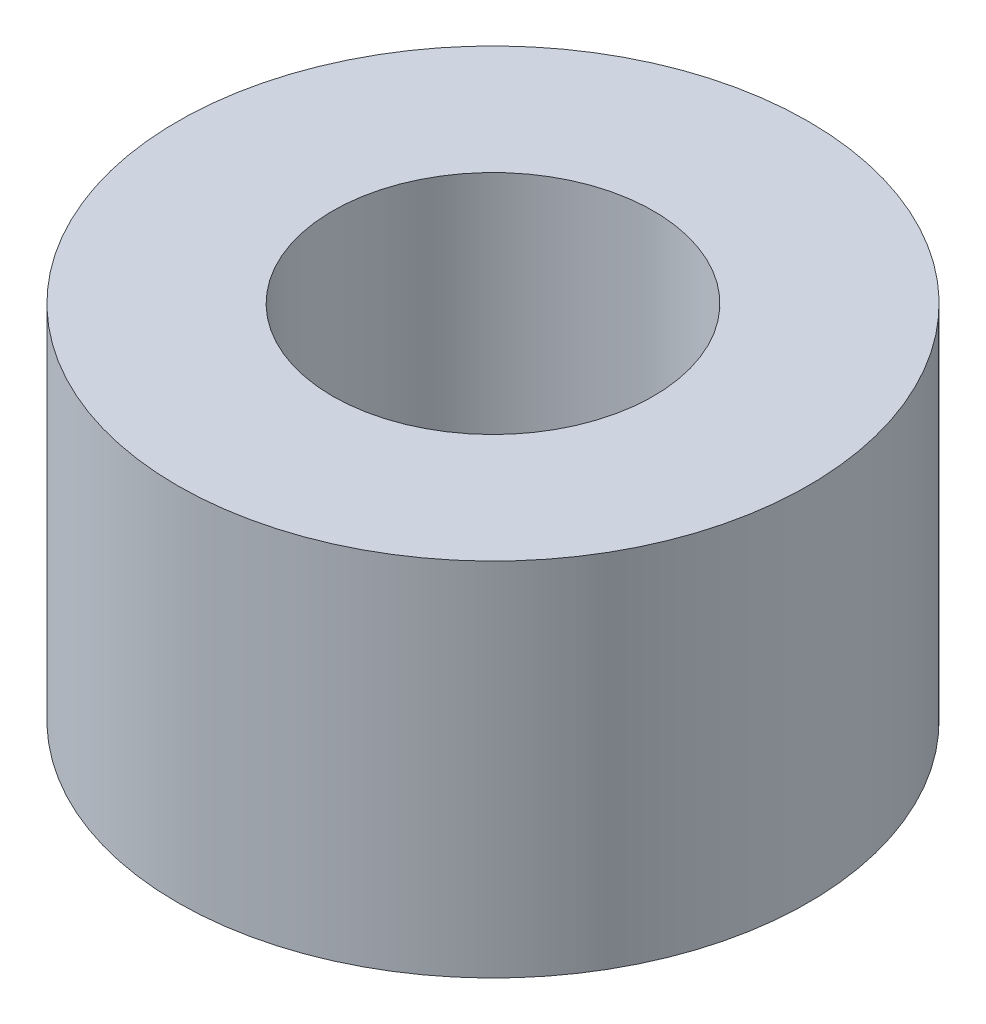
ISO-10303-21;
HEADER;
FILE_DESCRIPTION(('STEP AP214'),'2;1');
FILE_NAME('part.step','',(''),(''),'','','');
FILE_SCHEMA(('AUTOMOTIVE_DESIGN { 1 0 10303 214 1 1 1 1 }'));
ENDSEC;
DATA;
#1=APPLICATION_CONTEXT('core data for automotive mechanical design processes');
#2=APPLICATION_PROTOCOL_DEFINITION('international standard','automotive_design',2000,#1);
#3=PRODUCT_CONTEXT('',#1,'mechanical');
#4=PRODUCT('Part','Part','',(#3));
#5=PRODUCT_RELATED_PRODUCT_CATEGORY('part','',(#4));
#6=PRODUCT_DEFINITION_FORMATION('','',#4);
#7=PRODUCT_DEFINITION_CONTEXT('part definition',#1,'design');
#8=PRODUCT_DEFINITION('design','',#6,#7);
#9=PRODUCT_DEFINITION_SHAPE('','',#8);
#10=(LENGTH_UNIT() NAMED_UNIT(*) SI_UNIT(.MILLI.,.METRE.));
#11=(NAMED_UNIT(*) PLANE_ANGLE_UNIT() SI_UNIT($,.RADIAN.));
#12=(NAMED_UNIT(*) SI_UNIT($,.STERADIAN.) SOLID_ANGLE_UNIT());
#13=UNCERTAINTY_MEASURE_WITH_UNIT(LENGTH_MEASURE(1.E-05),#10,'distance_accuracy_value','');
#14=(GEOMETRIC_REPRESENTATION_CONTEXT(3) GLOBAL_UNCERTAINTY_ASSIGNED_CONTEXT((#13)) GLOBAL_UNIT_ASSIGNED_CONTEXT((#10,
#11,#12)) REPRESENTATION_CONTEXT('',''));
#15=CARTESIAN_POINT('',(0.,0.,0.));
#16=DIRECTION('',(0.,0.,1.));
#17=DIRECTION('',(1.,0.,0.));
#18=AXIS2_PLACEMENT_3D('',#15,#16,#17);
#19=CARTESIAN_POINT('',(0.,7.14502,0.));
#20=DIRECTION('',(0.,-1.,0.));
#21=DIRECTION('',(0.,0.,-1.));
#22=AXIS2_PLACEMENT_3D('',#19,#20,#21);
#23=CYLINDRICAL_SURFACE('',#22,6.24205);
#24=CARTESIAN_POINT('',(0.,7.14502,0.));
#25=DIRECTION('',(0.,1.,0.));
#26=DIRECTION('',(0.,0.,1.));
#27=AXIS2_PLACEMENT_3D('',#24,#25,#26);
#28=CIRCLE('',#27,6.24205);
#29=CARTESIAN_POINT('',(0.,7.14502,6.24205));
#30=VERTEX_POINT('',#29);
#31=EDGE_CURVE('E10',#30,#30,#28,.T.);
#32=ORIENTED_EDGE('',*,*,#31,.F.);
#33=EDGE_LOOP('',(#32));
#34=FACE_BOUND('',#33,.T.);
#35=CARTESIAN_POINT('',(0.,0.,0.));
#36=DIRECTION('',(0.,1.,0.));
#37=DIRECTION('',(0.,0.,1.));
#38=AXIS2_PLACEMENT_3D('',#35,#36,#37);
#39=CIRCLE('',#38,6.24205);
#40=CARTESIAN_POINT('',(0.,0.,6.24205));
#41=VERTEX_POINT('',#40);
#42=EDGE_CURVE('E35',#41,#41,#39,.T.);
#43=ORIENTED_EDGE('',*,*,#42,.T.);
#44=EDGE_LOOP('',(#43));
#45=FACE_BOUND('',#44,.T.);
#46=ADVANCED_FACE('F32',(#34,#45),#23,.T.);
#47=CARTESIAN_POINT('',(0.,7.14502,0.));
#48=DIRECTION('',(0.,1.,0.));
#49=DIRECTION('',(0.,0.,1.));
#50=AXIS2_PLACEMENT_3D('',#47,#48,#49);
#51=PLANE('',#50);
#52=CARTESIAN_POINT('',(0.,7.14502,0.));
#53=DIRECTION('',(0.,1.,0.));
#54=DIRECTION('',(0.,0.,1.));
#55=AXIS2_PLACEMENT_3D('',#52,#53,#54);
#56=CIRCLE('',#55,3.175);
#57=CARTESIAN_POINT('',(0.,7.14502,3.175));
#58=VERTEX_POINT('',#57);
#59=EDGE_CURVE('E42',#58,#58,#56,.T.);
#60=ORIENTED_EDGE('',*,*,#59,.F.);
#61=EDGE_LOOP('',(#60));
#62=FACE_BOUND('',#61,.T.);
#63=ORIENTED_EDGE('',*,*,#31,.T.);
#64=EDGE_LOOP('',(#63));
#65=FACE_BOUND('',#64,.T.);
#66=ADVANCED_FACE('F53',(#62,#65),#51,.T.);
#67=CARTESIAN_POINT('',(0.,0.,0.));
#68=DIRECTION('',(0.,1.,0.));
#69=DIRECTION('',(0.,0.,1.));
#70=AXIS2_PLACEMENT_3D('',#67,#68,#69);
#71=PLANE('',#70);
#72=CARTESIAN_POINT('',(0.,0.,0.));
#73=DIRECTION('',(0.,1.,0.));
#74=DIRECTION('',(0.,0.,1.));
#75=AXIS2_PLACEMENT_3D('',#72,#73,#74);
#76=CIRCLE('',#75,3.175);
#77=CARTESIAN_POINT('',(0.,0.,3.175));
#78=VERTEX_POINT('',#77);
#79=EDGE_CURVE('E44',#78,#78,#76,.T.);
#80=ORIENTED_EDGE('',*,*,#79,.T.);
#81=EDGE_LOOP('',(#80));
#82=FACE_BOUND('',#81,.T.);
#83=ORIENTED_EDGE('',*,*,#42,.F.);
#84=EDGE_LOOP('',(#83));
#85=FACE_BOUND('',#84,.T.);
#86=ADVANCED_FACE('F55',(#82,#85),#71,.F.);
#87=CARTESIAN_POINT('',(0.,7.14502,0.));
#88=DIRECTION('',(0.,-1.,0.));
#89=DIRECTION('',(0.,0.,-1.));
#90=AXIS2_PLACEMENT_3D('',#87,#88,#89);
#91=CYLINDRICAL_SURFACE('',#90,3.175);
#92=ORIENTED_EDGE('',*,*,#59,.T.);
#93=EDGE_LOOP('',(#92));
#94=FACE_BOUND('',#93,.T.);
#95=ORIENTED_EDGE('',*,*,#79,.F.);
#96=EDGE_LOOP('',(#95));
#97=FACE_BOUND('',#96,.T.);
#98=ADVANCED_FACE('F50',(#94,#97),#91,.F.);
#99=CLOSED_SHELL('',(#46,#66,#86,#98));
#100=MANIFOLD_SOLID_BREP('B2',#99);
#101=ADVANCED_BREP_SHAPE_REPRESENTATION('',(#18,#100),#14);
#102=SHAPE_DEFINITION_REPRESENTATION(#9,#101);
ENDSEC;
END-ISO-10303-21;
